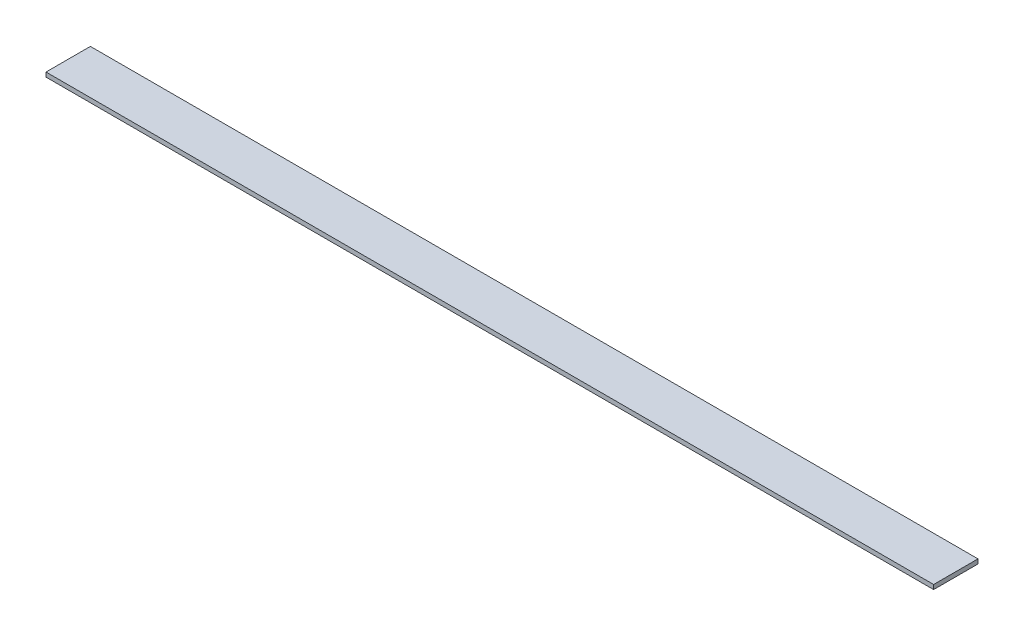
ISO-10303-21;
HEADER;
FILE_DESCRIPTION(('STEP AP214'),'2;1');
FILE_NAME('part.step','',(''),(''),'','','');
FILE_SCHEMA(('AUTOMOTIVE_DESIGN { 1 0 10303 214 1 1 1 1 }'));
ENDSEC;
DATA;
#1=APPLICATION_CONTEXT('core data for automotive mechanical design processes');
#2=APPLICATION_PROTOCOL_DEFINITION('international standard','automotive_design',2000,#1);
#3=PRODUCT_CONTEXT('',#1,'mechanical');
#4=PRODUCT('Part','Part','',(#3));
#5=PRODUCT_RELATED_PRODUCT_CATEGORY('part','',(#4));
#6=PRODUCT_DEFINITION_FORMATION('','',#4);
#7=PRODUCT_DEFINITION_CONTEXT('part definition',#1,'design');
#8=PRODUCT_DEFINITION('design','',#6,#7);
#9=PRODUCT_DEFINITION_SHAPE('','',#8);
#10=(LENGTH_UNIT() NAMED_UNIT(*) SI_UNIT(.MILLI.,.METRE.));
#11=(NAMED_UNIT(*) PLANE_ANGLE_UNIT() SI_UNIT($,.RADIAN.));
#12=(NAMED_UNIT(*) SI_UNIT($,.STERADIAN.) SOLID_ANGLE_UNIT());
#13=UNCERTAINTY_MEASURE_WITH_UNIT(LENGTH_MEASURE(1.E-05),#10,'distance_accuracy_value','');
#14=(GEOMETRIC_REPRESENTATION_CONTEXT(3) GLOBAL_UNCERTAINTY_ASSIGNED_CONTEXT((#13)) GLOBAL_UNIT_ASSIGNED_CONTEXT((#10,
#11,#12)) REPRESENTATION_CONTEXT('',''));
#15=CARTESIAN_POINT('',(0.,0.,0.));
#16=DIRECTION('',(0.,0.,1.));
#17=DIRECTION('',(1.,0.,0.));
#18=AXIS2_PLACEMENT_3D('',#15,#16,#17);
#19=CARTESIAN_POINT('',(-3000.,30.,-150.));
#20=DIRECTION('',(1.,0.,0.));
#21=DIRECTION('',(0.,0.,-1.));
#22=AXIS2_PLACEMENT_3D('',#19,#20,#21);
#23=PLANE('',#22);
#24=DIRECTION('',(0.,0.,1.));
#25=VECTOR('',#24,1.);
#26=CARTESIAN_POINT('',(-3000.,0.,-150.));
#27=LINE('',#26,#25);
#28=CARTESIAN_POINT('',(-3000.,0.,-150.));
#29=VERTEX_POINT('',#28);
#30=CARTESIAN_POINT('',(-3000.,0.,150.));
#31=VERTEX_POINT('',#30);
#32=EDGE_CURVE('E100',#29,#31,#27,.T.);
#33=ORIENTED_EDGE('',*,*,#32,.T.);
#34=DIRECTION('',(0.,-1.,0.));
#35=VECTOR('',#34,1.);
#36=CARTESIAN_POINT('',(-3000.,30.,150.));
#37=LINE('',#36,#35);
#38=CARTESIAN_POINT('',(-3000.,30.,150.));
#39=VERTEX_POINT('',#38);
#40=EDGE_CURVE('E11',#39,#31,#37,.T.);
#41=ORIENTED_EDGE('',*,*,#40,.F.);
#42=DIRECTION('',(0.,0.,1.));
#43=VECTOR('',#42,1.);
#44=CARTESIAN_POINT('',(-3000.,30.,-150.));
#45=LINE('',#44,#43);
#46=CARTESIAN_POINT('',(-3000.,30.,-150.));
#47=VERTEX_POINT('',#46);
#48=EDGE_CURVE('E88',#47,#39,#45,.T.);
#49=ORIENTED_EDGE('',*,*,#48,.F.);
#50=DIRECTION('',(0.,-1.,0.));
#51=VECTOR('',#50,1.);
#52=CARTESIAN_POINT('',(-3000.,30.,-150.));
#53=LINE('',#52,#51);
#54=EDGE_CURVE('E96',#47,#29,#53,.T.);
#55=ORIENTED_EDGE('',*,*,#54,.T.);
#56=EDGE_LOOP('',(#33,#41,#49,#55));
#57=FACE_BOUND('',#56,.T.);
#58=ADVANCED_FACE('F37',(#57),#23,.F.);
#59=CARTESIAN_POINT('',(-3000.,30.,150.));
#60=DIRECTION('',(0.,0.,-1.));
#61=DIRECTION('',(-1.,0.,0.));
#62=AXIS2_PLACEMENT_3D('',#59,#60,#61);
#63=PLANE('',#62);
#64=DIRECTION('',(1.,0.,0.));
#65=VECTOR('',#64,1.);
#66=CARTESIAN_POINT('',(-3000.,0.,150.));
#67=LINE('',#66,#65);
#68=CARTESIAN_POINT('',(3000.,0.,150.));
#69=VERTEX_POINT('',#68);
#70=EDGE_CURVE('E92',#31,#69,#67,.T.);
#71=ORIENTED_EDGE('',*,*,#70,.T.);
#72=DIRECTION('',(0.,-1.,0.));
#73=VECTOR('',#72,1.);
#74=CARTESIAN_POINT('',(3000.,30.,150.));
#75=LINE('',#74,#73);
#76=CARTESIAN_POINT('',(3000.,30.,150.));
#77=VERTEX_POINT('',#76);
#78=EDGE_CURVE('E45',#77,#69,#75,.T.);
#79=ORIENTED_EDGE('',*,*,#78,.F.);
#80=DIRECTION('',(1.,0.,0.));
#81=VECTOR('',#80,1.);
#82=CARTESIAN_POINT('',(-3000.,30.,150.));
#83=LINE('',#82,#81);
#84=EDGE_CURVE('E83',#39,#77,#83,.T.);
#85=ORIENTED_EDGE('',*,*,#84,.F.);
#86=ORIENTED_EDGE('',*,*,#40,.T.);
#87=EDGE_LOOP('',(#71,#79,#85,#86));
#88=FACE_BOUND('',#87,.T.);
#89=ADVANCED_FACE('F91',(#88),#63,.F.);
#90=CARTESIAN_POINT('',(3000.,30.,-150.));
#91=DIRECTION('',(-1.,0.,0.));
#92=DIRECTION('',(0.,0.,1.));
#93=AXIS2_PLACEMENT_3D('',#90,#91,#92);
#94=PLANE('',#93);
#95=DIRECTION('',(0.,0.,-1.));
#96=VECTOR('',#95,1.);
#97=CARTESIAN_POINT('',(3000.,0.,-150.));
#98=LINE('',#97,#96);
#99=CARTESIAN_POINT('',(3000.,0.,-150.));
#100=VERTEX_POINT('',#99);
#101=EDGE_CURVE('E70',#69,#100,#98,.T.);
#102=ORIENTED_EDGE('',*,*,#101,.T.);
#103=DIRECTION('',(0.,-1.,0.));
#104=VECTOR('',#103,1.);
#105=CARTESIAN_POINT('',(3000.,30.,-150.));
#106=LINE('',#105,#104);
#107=CARTESIAN_POINT('',(3000.,30.,-150.));
#108=VERTEX_POINT('',#107);
#109=EDGE_CURVE('E93',#108,#100,#106,.T.);
#110=ORIENTED_EDGE('',*,*,#109,.F.);
#111=DIRECTION('',(0.,0.,-1.));
#112=VECTOR('',#111,1.);
#113=CARTESIAN_POINT('',(3000.,30.,-150.));
#114=LINE('',#113,#112);
#115=EDGE_CURVE('E86',#77,#108,#114,.T.);
#116=ORIENTED_EDGE('',*,*,#115,.F.);
#117=ORIENTED_EDGE('',*,*,#78,.T.);
#118=EDGE_LOOP('',(#102,#110,#116,#117));
#119=FACE_BOUND('',#118,.T.);
#120=ADVANCED_FACE('F94',(#119),#94,.F.);
#121=CARTESIAN_POINT('',(-3000.,30.,-150.));
#122=DIRECTION('',(0.,0.,1.));
#123=DIRECTION('',(1.,0.,0.));
#124=AXIS2_PLACEMENT_3D('',#121,#122,#123);
#125=PLANE('',#124);
#126=DIRECTION('',(-1.,0.,0.));
#127=VECTOR('',#126,1.);
#128=CARTESIAN_POINT('',(-3000.,0.,-150.));
#129=LINE('',#128,#127);
#130=EDGE_CURVE('E76',#100,#29,#129,.T.);
#131=ORIENTED_EDGE('',*,*,#130,.T.);
#132=ORIENTED_EDGE('',*,*,#54,.F.);
#133=DIRECTION('',(-1.,0.,0.));
#134=VECTOR('',#133,1.);
#135=CARTESIAN_POINT('',(-3000.,30.,-150.));
#136=LINE('',#135,#134);
#137=EDGE_CURVE('E53',#108,#47,#136,.T.);
#138=ORIENTED_EDGE('',*,*,#137,.F.);
#139=ORIENTED_EDGE('',*,*,#109,.T.);
#140=EDGE_LOOP('',(#131,#132,#138,#139));
#141=FACE_BOUND('',#140,.T.);
#142=ADVANCED_FACE('F107',(#141),#125,.F.);
#143=CARTESIAN_POINT('',(0.,30.,0.));
#144=DIRECTION('',(0.,1.,0.));
#145=DIRECTION('',(0.,0.,1.));
#146=AXIS2_PLACEMENT_3D('',#143,#144,#145);
#147=PLANE('',#146);
#148=ORIENTED_EDGE('',*,*,#48,.T.);
#149=ORIENTED_EDGE('',*,*,#84,.T.);
#150=ORIENTED_EDGE('',*,*,#115,.T.);
#151=ORIENTED_EDGE('',*,*,#137,.T.);
#152=EDGE_LOOP('',(#148,#149,#150,#151));
#153=FACE_BOUND('',#152,.T.);
#154=ADVANCED_FACE('F84',(#153),#147,.T.);
#155=CARTESIAN_POINT('',(0.,0.,0.));
#156=DIRECTION('',(0.,1.,0.));
#157=DIRECTION('',(0.,0.,1.));
#158=AXIS2_PLACEMENT_3D('',#155,#156,#157);
#159=PLANE('',#158);
#160=ORIENTED_EDGE('',*,*,#32,.F.);
#161=ORIENTED_EDGE('',*,*,#130,.F.);
#162=ORIENTED_EDGE('',*,*,#101,.F.);
#163=ORIENTED_EDGE('',*,*,#70,.F.);
#164=EDGE_LOOP('',(#160,#161,#162,#163));
#165=FACE_BOUND('',#164,.T.);
#166=ADVANCED_FACE('F110',(#165),#159,.F.);
#167=CLOSED_SHELL('',(#58,#89,#120,#142,#154,#166));
#168=MANIFOLD_SOLID_BREP('B2',#167);
#169=ADVANCED_BREP_SHAPE_REPRESENTATION('',(#18,#168),#14);
#170=SHAPE_DEFINITION_REPRESENTATION(#9,#169);
ENDSEC;
END-ISO-10303-21;
